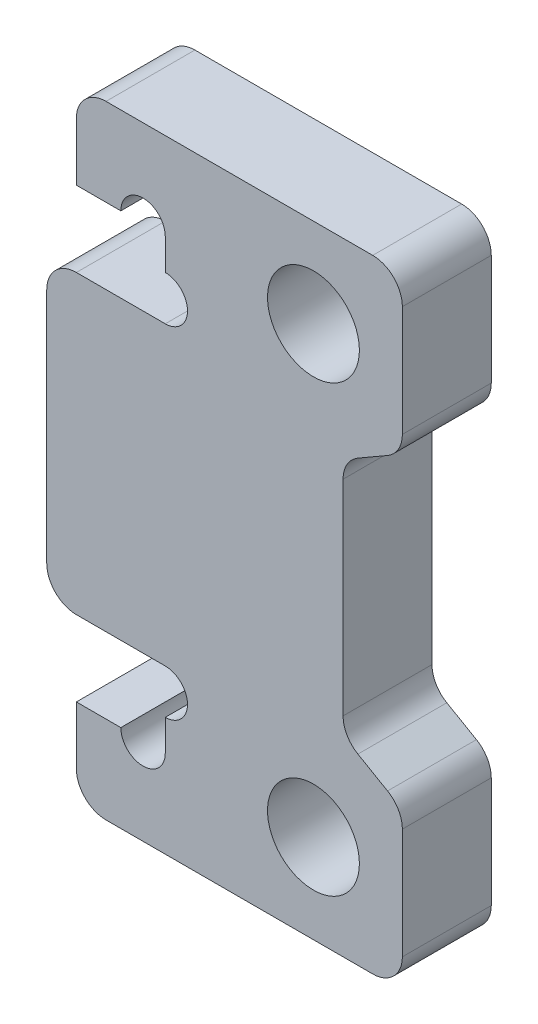
ISO-10303-21;
HEADER;
FILE_DESCRIPTION(('STEP AP214'),'2;1');
FILE_NAME('part.step','',(''),(''),'','','');
FILE_SCHEMA(('AUTOMOTIVE_DESIGN { 1 0 10303 214 1 1 1 1 }'));
ENDSEC;
DATA;
#1=APPLICATION_CONTEXT('core data for automotive mechanical design processes');
#2=APPLICATION_PROTOCOL_DEFINITION('international standard','automotive_design',2000,#1);
#3=PRODUCT_CONTEXT('',#1,'mechanical');
#4=PRODUCT('Part','Part','',(#3));
#5=PRODUCT_RELATED_PRODUCT_CATEGORY('part','',(#4));
#6=PRODUCT_DEFINITION_FORMATION('','',#4);
#7=PRODUCT_DEFINITION_CONTEXT('part definition',#1,'design');
#8=PRODUCT_DEFINITION('design','',#6,#7);
#9=PRODUCT_DEFINITION_SHAPE('','',#8);
#10=(LENGTH_UNIT() NAMED_UNIT(*) SI_UNIT(.MILLI.,.METRE.));
#11=(NAMED_UNIT(*) PLANE_ANGLE_UNIT() SI_UNIT($,.RADIAN.));
#12=(NAMED_UNIT(*) SI_UNIT($,.STERADIAN.) SOLID_ANGLE_UNIT());
#13=UNCERTAINTY_MEASURE_WITH_UNIT(LENGTH_MEASURE(1.E-05),#10,'distance_accuracy_value','');
#14=(GEOMETRIC_REPRESENTATION_CONTEXT(3) GLOBAL_UNCERTAINTY_ASSIGNED_CONTEXT((#13)) GLOBAL_UNIT_ASSIGNED_CONTEXT((#10,
#11,#12)) REPRESENTATION_CONTEXT('',''));
#15=CARTESIAN_POINT('',(0.,0.,0.));
#16=DIRECTION('',(0.,0.,1.));
#17=DIRECTION('',(1.,0.,0.));
#18=AXIS2_PLACEMENT_3D('',#15,#16,#17);
#19=CARTESIAN_POINT('',(-5.,10.5,1.5));
#20=DIRECTION('',(1.,0.,0.));
#21=DIRECTION('',(0.,1.,0.));
#22=AXIS2_PLACEMENT_3D('',#19,#20,#21);
#23=PLANE('',#22);
#24=DIRECTION('',(0.,-1.,0.));
#25=VECTOR('',#24,1.);
#26=CARTESIAN_POINT('',(-5.,10.5,-1.5));
#27=LINE('',#26,#25);
#28=CARTESIAN_POINT('',(-5.,7.55,-1.5));
#29=VERTEX_POINT('',#28);
#30=CARTESIAN_POINT('',(-5.,6.5,-1.5));
#31=VERTEX_POINT('',#30);
#32=EDGE_CURVE('E287',#29,#31,#27,.T.);
#33=ORIENTED_EDGE('',*,*,#32,.T.);
#34=DIRECTION('',(0.,0.,1.));
#35=VECTOR('',#34,1.);
#36=CARTESIAN_POINT('',(-5.,6.5,-1.5));
#37=LINE('',#36,#35);
#38=CARTESIAN_POINT('',(-5.,6.5,1.5));
#39=VERTEX_POINT('',#38);
#40=EDGE_CURVE('E240',#31,#39,#37,.T.);
#41=ORIENTED_EDGE('',*,*,#40,.T.);
#42=DIRECTION('',(0.,-1.,0.));
#43=VECTOR('',#42,1.);
#44=CARTESIAN_POINT('',(-5.,10.5,1.5));
#45=LINE('',#44,#43);
#46=CARTESIAN_POINT('',(-5.,7.55,1.5));
#47=VERTEX_POINT('',#46);
#48=EDGE_CURVE('E256',#47,#39,#45,.T.);
#49=ORIENTED_EDGE('',*,*,#48,.F.);
#50=DIRECTION('',(0.,0.,1.));
#51=VECTOR('',#50,1.);
#52=CARTESIAN_POINT('',(-5.,7.55,-12.270329614269));
#53=LINE('',#52,#51);
#54=EDGE_CURVE('E449',#29,#47,#53,.T.);
#55=ORIENTED_EDGE('',*,*,#54,.F.);
#56=EDGE_LOOP('',(#33,#41,#49,#55));
#57=FACE_BOUND('',#56,.T.);
#58=ADVANCED_FACE('F32',(#57),#23,.F.);
#59=CARTESIAN_POINT('',(-5.,-6.5,1.5));
#60=VERTEX_POINT('',#59);
#61=CARTESIAN_POINT('',(-5.,-7.55,1.5));
#62=VERTEX_POINT('',#61);
#63=EDGE_CURVE('E248',#60,#62,#45,.T.);
#64=ORIENTED_EDGE('',*,*,#63,.F.);
#65=DIRECTION('',(0.,0.,1.));
#66=VECTOR('',#65,1.);
#67=CARTESIAN_POINT('',(-5.,-6.5,-1.5));
#68=LINE('',#67,#66);
#69=CARTESIAN_POINT('',(-5.,-6.5,-1.5));
#70=VERTEX_POINT('',#69);
#71=EDGE_CURVE('E228',#60,#70,#68,.F.);
#72=ORIENTED_EDGE('',*,*,#71,.T.);
#73=CARTESIAN_POINT('',(-5.,-7.55,-1.5));
#74=VERTEX_POINT('',#73);
#75=EDGE_CURVE('E285',#70,#74,#27,.T.);
#76=ORIENTED_EDGE('',*,*,#75,.T.);
#77=DIRECTION('',(0.,0.,1.));
#78=VECTOR('',#77,1.);
#79=CARTESIAN_POINT('',(-5.,-7.55,-12.270329614269));
#80=LINE('',#79,#78);
#81=EDGE_CURVE('E255',#74,#62,#80,.T.);
#82=ORIENTED_EDGE('',*,*,#81,.T.);
#83=EDGE_LOOP('',(#64,#72,#76,#82));
#84=FACE_BOUND('',#83,.T.);
#85=ADVANCED_FACE('F254',(#84),#23,.F.);
#86=CARTESIAN_POINT('',(0.,0.,1.5));
#87=DIRECTION('',(0.,0.,-1.));
#88=DIRECTION('',(-1.,0.,0.));
#89=AXIS2_PLACEMENT_3D('',#86,#87,#88);
#90=PLANE('',#89);
#91=DIRECTION('',(0.86602540378444,0.499999999999998,0.));
#92=VECTOR('',#91,1.);
#93=CARTESIAN_POINT('',(3.,5.19059892324148,1.5));
#94=LINE('',#93,#92);
#95=CARTESIAN_POINT('',(1.50000000000001,4.32457351945705,1.5));
#96=VERTEX_POINT('',#95);
#97=CARTESIAN_POINT('',(2.5,4.90192378864667,1.5));
#98=VERTEX_POINT('',#97);
#99=EDGE_CURVE('E276',#96,#98,#94,.T.);
#100=ORIENTED_EDGE('',*,*,#99,.T.);
#101=CARTESIAN_POINT('',(2.,5.76794919243111,1.5));
#102=DIRECTION('',(0.,0.,-1.));
#103=DIRECTION('',(-1.,0.,0.));
#104=AXIS2_PLACEMENT_3D('',#101,#102,#103);
#105=CIRCLE('',#104,1.);
#106=CARTESIAN_POINT('',(3.,5.76794919243111,1.5));
#107=VERTEX_POINT('',#106);
#108=EDGE_CURVE('E349',#98,#107,#105,.F.);
#109=ORIENTED_EDGE('',*,*,#108,.T.);
#110=DIRECTION('',(0.,1.,0.));
#111=VECTOR('',#110,1.);
#112=CARTESIAN_POINT('',(3.,10.5,1.5));
#113=LINE('',#112,#111);
#114=CARTESIAN_POINT('',(3.,9.5,1.5));
#115=VERTEX_POINT('',#114);
#116=EDGE_CURVE('E278',#107,#115,#113,.T.);
#117=ORIENTED_EDGE('',*,*,#116,.T.);
#118=CARTESIAN_POINT('',(2.,9.5,1.5));
#119=DIRECTION('',(0.,0.,-1.));
#120=DIRECTION('',(-1.,0.,0.));
#121=AXIS2_PLACEMENT_3D('',#118,#119,#120);
#122=CIRCLE('',#121,1.);
#123=CARTESIAN_POINT('',(2.,10.5,1.5));
#124=VERTEX_POINT('',#123);
#125=EDGE_CURVE('E343',#115,#124,#122,.F.);
#126=ORIENTED_EDGE('',*,*,#125,.T.);
#127=DIRECTION('',(-1.,0.,0.));
#128=VECTOR('',#127,1.);
#129=CARTESIAN_POINT('',(-5.,10.5,1.5));
#130=LINE('',#129,#128);
#131=CARTESIAN_POINT('',(-7.,10.5,1.5));
#132=VERTEX_POINT('',#131);
#133=EDGE_CURVE('E257',#124,#132,#130,.T.);
#134=ORIENTED_EDGE('',*,*,#133,.T.);
#135=CARTESIAN_POINT('',(-7.,9.5,1.5));
#136=DIRECTION('',(0.,0.,-1.));
#137=DIRECTION('',(-1.,0.,0.));
#138=AXIS2_PLACEMENT_3D('',#135,#136,#137);
#139=CIRCLE('',#138,1.);
#140=CARTESIAN_POINT('',(-8.,9.5,1.5));
#141=VERTEX_POINT('',#140);
#142=EDGE_CURVE('E47',#132,#141,#139,.F.);
#143=ORIENTED_EDGE('',*,*,#142,.T.);
#144=DIRECTION('',(0.,-1.,0.));
#145=VECTOR('',#144,1.);
#146=CARTESIAN_POINT('',(-8.,10.5,1.5));
#147=LINE('',#146,#145);
#148=CARTESIAN_POINT('',(-8.,7.55,1.5));
#149=VERTEX_POINT('',#148);
#150=EDGE_CURVE('E444',#141,#149,#147,.T.);
#151=ORIENTED_EDGE('',*,*,#150,.T.);
#152=DIRECTION('',(1.,0.,0.));
#153=VECTOR('',#152,1.);
#154=CARTESIAN_POINT('',(-8.,7.55,1.5));
#155=LINE('',#154,#153);
#156=CARTESIAN_POINT('',(-6.5,7.55,1.5));
#157=VERTEX_POINT('',#156);
#158=EDGE_CURVE('E440',#149,#157,#155,.T.);
#159=ORIENTED_EDGE('',*,*,#158,.T.);
#160=CARTESIAN_POINT('',(-5.75,7.55,1.5));
#161=DIRECTION('',(0.,0.,1.));
#162=DIRECTION('',(1.,0.,0.));
#163=AXIS2_PLACEMENT_3D('',#160,#161,#162);
#164=CIRCLE('',#163,0.75);
#165=EDGE_CURVE('E564',#47,#157,#164,.T.);
#166=ORIENTED_EDGE('',*,*,#165,.F.);
#167=ORIENTED_EDGE('',*,*,#48,.T.);
#168=CARTESIAN_POINT('',(-5.,5.75,1.5));
#169=DIRECTION('',(0.,0.,1.));
#170=DIRECTION('',(1.,0.,0.));
#171=AXIS2_PLACEMENT_3D('',#168,#169,#170);
#172=CIRCLE('',#171,0.75);
#173=CARTESIAN_POINT('',(-5.,5.,1.5));
#174=VERTEX_POINT('',#173);
#175=EDGE_CURVE('E572',#174,#39,#172,.T.);
#176=ORIENTED_EDGE('',*,*,#175,.F.);
#177=DIRECTION('',(-1.,0.,0.));
#178=VECTOR('',#177,1.);
#179=CARTESIAN_POINT('',(-5.,5.,1.5));
#180=LINE('',#179,#178);
#181=CARTESIAN_POINT('',(-8.,5.,1.5));
#182=VERTEX_POINT('',#181);
#183=EDGE_CURVE('E581',#174,#182,#180,.T.);
#184=ORIENTED_EDGE('',*,*,#183,.T.);
#185=CARTESIAN_POINT('',(-8.,4.,1.5));
#186=DIRECTION('',(0.,0.,-1.));
#187=DIRECTION('',(-1.,0.,0.));
#188=AXIS2_PLACEMENT_3D('',#185,#186,#187);
#189=CIRCLE('',#188,1.);
#190=CARTESIAN_POINT('',(-9.,4.,1.5));
#191=VERTEX_POINT('',#190);
#192=EDGE_CURVE('E336',#182,#191,#189,.F.);
#193=ORIENTED_EDGE('',*,*,#192,.T.);
#194=DIRECTION('',(0.,-1.,0.));
#195=VECTOR('',#194,1.);
#196=CARTESIAN_POINT('',(-9.,5.,1.5));
#197=LINE('',#196,#195);
#198=CARTESIAN_POINT('',(-9.,-4.,1.5));
#199=VERTEX_POINT('',#198);
#200=EDGE_CURVE('E583',#191,#199,#197,.T.);
#201=ORIENTED_EDGE('',*,*,#200,.T.);
#202=CARTESIAN_POINT('',(-8.,-4.,1.5));
#203=DIRECTION('',(0.,0.,-1.));
#204=DIRECTION('',(-1.,0.,0.));
#205=AXIS2_PLACEMENT_3D('',#202,#203,#204);
#206=CIRCLE('',#205,1.);
#207=CARTESIAN_POINT('',(-8.,-5.,1.5));
#208=VERTEX_POINT('',#207);
#209=EDGE_CURVE('E338',#199,#208,#206,.F.);
#210=ORIENTED_EDGE('',*,*,#209,.T.);
#211=DIRECTION('',(1.,0.,0.));
#212=VECTOR('',#211,1.);
#213=CARTESIAN_POINT('',(-9.,-5.,1.5));
#214=LINE('',#213,#212);
#215=CARTESIAN_POINT('',(-5.,-5.,1.5));
#216=VERTEX_POINT('',#215);
#217=EDGE_CURVE('E251',#208,#216,#214,.T.);
#218=ORIENTED_EDGE('',*,*,#217,.T.);
#219=CARTESIAN_POINT('',(-5.,-5.75,1.5));
#220=DIRECTION('',(0.,0.,1.));
#221=DIRECTION('',(1.,0.,0.));
#222=AXIS2_PLACEMENT_3D('',#219,#220,#221);
#223=CIRCLE('',#222,0.75);
#224=EDGE_CURVE('E232',#60,#216,#223,.T.);
#225=ORIENTED_EDGE('',*,*,#224,.F.);
#226=ORIENTED_EDGE('',*,*,#63,.T.);
#227=CARTESIAN_POINT('',(-5.75,-7.55,1.5));
#228=DIRECTION('',(0.,0.,1.));
#229=DIRECTION('',(1.,0.,0.));
#230=AXIS2_PLACEMENT_3D('',#227,#228,#229);
#231=CIRCLE('',#230,0.75);
#232=CARTESIAN_POINT('',(-6.5,-7.55,1.5));
#233=VERTEX_POINT('',#232);
#234=EDGE_CURVE('E577',#233,#62,#231,.T.);
#235=ORIENTED_EDGE('',*,*,#234,.F.);
#236=DIRECTION('',(-1.,0.,0.));
#237=VECTOR('',#236,1.);
#238=CARTESIAN_POINT('',(-5.,-7.55,1.5));
#239=LINE('',#238,#237);
#240=CARTESIAN_POINT('',(-8.,-7.55,1.5));
#241=VERTEX_POINT('',#240);
#242=EDGE_CURVE('E544',#233,#241,#239,.T.);
#243=ORIENTED_EDGE('',*,*,#242,.T.);
#244=DIRECTION('',(0.,-1.,0.));
#245=VECTOR('',#244,1.);
#246=CARTESIAN_POINT('',(-8.,-7.55,1.5));
#247=LINE('',#246,#245);
#248=CARTESIAN_POINT('',(-8.,-9.5,1.5));
#249=VERTEX_POINT('',#248);
#250=EDGE_CURVE('E545',#241,#249,#247,.T.);
#251=ORIENTED_EDGE('',*,*,#250,.T.);
#252=CARTESIAN_POINT('',(-7.,-9.5,1.5));
#253=DIRECTION('',(0.,0.,-1.));
#254=DIRECTION('',(-1.,0.,0.));
#255=AXIS2_PLACEMENT_3D('',#252,#253,#254);
#256=CIRCLE('',#255,1.);
#257=CARTESIAN_POINT('',(-7.,-10.5,1.5));
#258=VERTEX_POINT('',#257);
#259=EDGE_CURVE('E340',#249,#258,#256,.F.);
#260=ORIENTED_EDGE('',*,*,#259,.T.);
#261=DIRECTION('',(1.,0.,0.));
#262=VECTOR('',#261,1.);
#263=CARTESIAN_POINT('',(3.00000000000001,-10.5,1.5));
#264=LINE('',#263,#262);
#265=CARTESIAN_POINT('',(2.00000000000001,-10.5,1.5));
#266=VERTEX_POINT('',#265);
#267=EDGE_CURVE('E260',#258,#266,#264,.T.);
#268=ORIENTED_EDGE('',*,*,#267,.T.);
#269=CARTESIAN_POINT('',(2.00000000000001,-9.5,1.5));
#270=DIRECTION('',(0.,0.,-1.));
#271=DIRECTION('',(-1.,0.,0.));
#272=AXIS2_PLACEMENT_3D('',#269,#270,#271);
#273=CIRCLE('',#272,1.);
#274=CARTESIAN_POINT('',(3.00000000000001,-9.5,1.5));
#275=VERTEX_POINT('',#274);
#276=EDGE_CURVE('E345',#266,#275,#273,.F.);
#277=ORIENTED_EDGE('',*,*,#276,.T.);
#278=DIRECTION('',(0.,1.,0.));
#279=VECTOR('',#278,1.);
#280=CARTESIAN_POINT('',(3.,-5.19059892324149,1.5));
#281=LINE('',#280,#279);
#282=CARTESIAN_POINT('',(3.,-5.76794919243112,1.5));
#283=VERTEX_POINT('',#282);
#284=EDGE_CURVE('E267',#275,#283,#281,.T.);
#285=ORIENTED_EDGE('',*,*,#284,.T.);
#286=CARTESIAN_POINT('',(2.,-5.76794919243112,1.5));
#287=DIRECTION('',(0.,0.,-1.));
#288=DIRECTION('',(-1.,0.,0.));
#289=AXIS2_PLACEMENT_3D('',#286,#287,#288);
#290=CIRCLE('',#289,1.);
#291=CARTESIAN_POINT('',(2.5,-4.90192378864668,1.5));
#292=VERTEX_POINT('',#291);
#293=EDGE_CURVE('E347',#283,#292,#290,.F.);
#294=ORIENTED_EDGE('',*,*,#293,.T.);
#295=DIRECTION('',(-0.86602540378444,0.499999999999998,0.));
#296=VECTOR('',#295,1.);
#297=CARTESIAN_POINT('',(1.,-4.03589838486224,1.5));
#298=LINE('',#297,#296);
#299=CARTESIAN_POINT('',(1.5,-4.32457351945706,1.5));
#300=VERTEX_POINT('',#299);
#301=EDGE_CURVE('E270',#292,#300,#298,.T.);
#302=ORIENTED_EDGE('',*,*,#301,.T.);
#303=CARTESIAN_POINT('',(2.,-3.45854811567262,1.5));
#304=DIRECTION('',(0.,0.,-1.));
#305=DIRECTION('',(-1.,0.,0.));
#306=AXIS2_PLACEMENT_3D('',#303,#304,#305);
#307=CIRCLE('',#306,1.);
#308=CARTESIAN_POINT('',(1.,-3.45854811567262,1.5));
#309=VERTEX_POINT('',#308);
#310=EDGE_CURVE('E392',#300,#309,#307,.T.);
#311=ORIENTED_EDGE('',*,*,#310,.T.);
#312=DIRECTION('',(0.,1.,0.));
#313=VECTOR('',#312,1.);
#314=CARTESIAN_POINT('',(1.00000000000001,4.03589838486223,1.5));
#315=LINE('',#314,#313);
#316=CARTESIAN_POINT('',(1.00000000000001,3.45854811567261,1.5));
#317=VERTEX_POINT('',#316);
#318=EDGE_CURVE('E273',#309,#317,#315,.T.);
#319=ORIENTED_EDGE('',*,*,#318,.T.);
#320=CARTESIAN_POINT('',(2.00000000000001,3.45854811567261,1.5));
#321=DIRECTION('',(0.,0.,-1.));
#322=DIRECTION('',(-1.,0.,0.));
#323=AXIS2_PLACEMENT_3D('',#320,#321,#322);
#324=CIRCLE('',#323,1.);
#325=EDGE_CURVE('E11',#317,#96,#324,.T.);
#326=ORIENTED_EDGE('',*,*,#325,.T.);
#327=EDGE_LOOP('',(#100,#109,#117,#126,#134,#143,#151,#159,#166,#167,#176,#184,#193,#201,#210,
#218,#225,#226,#235,#243,#251,#260,#268,#277,#285,#294,#302,#311,#319,#326));
#328=FACE_BOUND('',#327,.T.);
#329=CARTESIAN_POINT('',(0.,7.5,1.5));
#330=DIRECTION('',(0.,0.,1.));
#331=DIRECTION('',(1.,0.,0.));
#332=AXIS2_PLACEMENT_3D('',#329,#330,#331);
#333=CIRCLE('',#332,1.55);
#334=CARTESIAN_POINT('',(1.55,7.5,1.5));
#335=VERTEX_POINT('',#334);
#336=EDGE_CURVE('E286',#335,#335,#333,.T.);
#337=ORIENTED_EDGE('',*,*,#336,.F.);
#338=EDGE_LOOP('',(#337));
#339=FACE_BOUND('',#338,.T.);
#340=CARTESIAN_POINT('',(0.,-7.5,1.5));
#341=DIRECTION('',(0.,0.,1.));
#342=DIRECTION('',(1.,0.,0.));
#343=AXIS2_PLACEMENT_3D('',#340,#341,#342);
#344=CIRCLE('',#343,1.55);
#345=CARTESIAN_POINT('',(1.55,-7.5,1.5));
#346=VERTEX_POINT('',#345);
#347=EDGE_CURVE('E452',#346,#346,#344,.T.);
#348=ORIENTED_EDGE('',*,*,#347,.F.);
#349=EDGE_LOOP('',(#348));
#350=FACE_BOUND('',#349,.T.);
#351=ADVANCED_FACE('F245',(#328,#339,#350),#90,.F.);
#352=CARTESIAN_POINT('',(0.,0.,-1.5));
#353=DIRECTION('',(0.,0.,-1.));
#354=DIRECTION('',(-1.,0.,0.));
#355=AXIS2_PLACEMENT_3D('',#352,#353,#354);
#356=PLANE('',#355);
#357=DIRECTION('',(0.,1.,0.));
#358=VECTOR('',#357,1.);
#359=CARTESIAN_POINT('',(3.,10.5,-1.5));
#360=LINE('',#359,#358);
#361=CARTESIAN_POINT('',(3.,5.76794919243111,-1.5));
#362=VERTEX_POINT('',#361);
#363=CARTESIAN_POINT('',(3.,9.5,-1.5));
#364=VERTEX_POINT('',#363);
#365=EDGE_CURVE('E261',#362,#364,#360,.T.);
#366=ORIENTED_EDGE('',*,*,#365,.F.);
#367=CARTESIAN_POINT('',(2.,5.76794919243111,-1.5));
#368=DIRECTION('',(0.,0.,-1.));
#369=DIRECTION('',(-1.,0.,0.));
#370=AXIS2_PLACEMENT_3D('',#367,#368,#369);
#371=CIRCLE('',#370,1.);
#372=CARTESIAN_POINT('',(2.5,4.90192378864667,-1.5));
#373=VERTEX_POINT('',#372);
#374=EDGE_CURVE('E329',#362,#373,#371,.T.);
#375=ORIENTED_EDGE('',*,*,#374,.T.);
#376=DIRECTION('',(0.86602540378444,0.499999999999998,0.));
#377=VECTOR('',#376,1.);
#378=CARTESIAN_POINT('',(3.,5.19059892324148,-1.5));
#379=LINE('',#378,#377);
#380=CARTESIAN_POINT('',(1.50000000000001,4.32457351945705,-1.5));
#381=VERTEX_POINT('',#380);
#382=EDGE_CURVE('E302',#381,#373,#379,.T.);
#383=ORIENTED_EDGE('',*,*,#382,.F.);
#384=CARTESIAN_POINT('',(2.00000000000001,3.45854811567261,-1.5));
#385=DIRECTION('',(0.,0.,-1.));
#386=DIRECTION('',(-1.,0.,0.));
#387=AXIS2_PLACEMENT_3D('',#384,#385,#386);
#388=CIRCLE('',#387,1.);
#389=CARTESIAN_POINT('',(1.00000000000001,3.45854811567261,-1.5));
#390=VERTEX_POINT('',#389);
#391=EDGE_CURVE('E40',#381,#390,#388,.F.);
#392=ORIENTED_EDGE('',*,*,#391,.T.);
#393=DIRECTION('',(0.,1.,0.));
#394=VECTOR('',#393,1.);
#395=CARTESIAN_POINT('',(1.00000000000001,4.03589838486223,-1.5));
#396=LINE('',#395,#394);
#397=CARTESIAN_POINT('',(1.,-3.45854811567262,-1.5));
#398=VERTEX_POINT('',#397);
#399=EDGE_CURVE('E299',#398,#390,#396,.T.);
#400=ORIENTED_EDGE('',*,*,#399,.F.);
#401=CARTESIAN_POINT('',(2.,-3.45854811567262,-1.5));
#402=DIRECTION('',(0.,0.,-1.));
#403=DIRECTION('',(-1.,0.,0.));
#404=AXIS2_PLACEMENT_3D('',#401,#402,#403);
#405=CIRCLE('',#404,1.);
#406=CARTESIAN_POINT('',(1.5,-4.32457351945706,-1.5));
#407=VERTEX_POINT('',#406);
#408=EDGE_CURVE('E390',#398,#407,#405,.F.);
#409=ORIENTED_EDGE('',*,*,#408,.T.);
#410=DIRECTION('',(-0.86602540378444,0.499999999999998,0.));
#411=VECTOR('',#410,1.);
#412=CARTESIAN_POINT('',(1.,-4.03589838486224,-1.5));
#413=LINE('',#412,#411);
#414=CARTESIAN_POINT('',(2.5,-4.90192378864668,-1.5));
#415=VERTEX_POINT('',#414);
#416=EDGE_CURVE('E296',#415,#407,#413,.T.);
#417=ORIENTED_EDGE('',*,*,#416,.F.);
#418=CARTESIAN_POINT('',(2.,-5.76794919243112,-1.5));
#419=DIRECTION('',(0.,0.,-1.));
#420=DIRECTION('',(-1.,0.,0.));
#421=AXIS2_PLACEMENT_3D('',#418,#419,#420);
#422=CIRCLE('',#421,1.);
#423=CARTESIAN_POINT('',(3.,-5.76794919243112,-1.5));
#424=VERTEX_POINT('',#423);
#425=EDGE_CURVE('E327',#415,#424,#422,.T.);
#426=ORIENTED_EDGE('',*,*,#425,.T.);
#427=DIRECTION('',(0.,1.,0.));
#428=VECTOR('',#427,1.);
#429=CARTESIAN_POINT('',(3.,-5.19059892324149,-1.5));
#430=LINE('',#429,#428);
#431=CARTESIAN_POINT('',(3.00000000000001,-9.5,-1.5));
#432=VERTEX_POINT('',#431);
#433=EDGE_CURVE('E293',#432,#424,#430,.T.);
#434=ORIENTED_EDGE('',*,*,#433,.F.);
#435=CARTESIAN_POINT('',(2.00000000000001,-9.5,-1.5));
#436=DIRECTION('',(0.,0.,-1.));
#437=DIRECTION('',(-1.,0.,0.));
#438=AXIS2_PLACEMENT_3D('',#435,#436,#437);
#439=CIRCLE('',#438,1.);
#440=CARTESIAN_POINT('',(2.00000000000001,-10.5,-1.5));
#441=VERTEX_POINT('',#440);
#442=EDGE_CURVE('E325',#432,#441,#439,.T.);
#443=ORIENTED_EDGE('',*,*,#442,.T.);
#444=DIRECTION('',(1.,0.,0.));
#445=VECTOR('',#444,1.);
#446=CARTESIAN_POINT('',(3.00000000000001,-10.5,-1.5));
#447=LINE('',#446,#445);
#448=CARTESIAN_POINT('',(-7.,-10.5,-1.5));
#449=VERTEX_POINT('',#448);
#450=EDGE_CURVE('E290',#449,#441,#447,.T.);
#451=ORIENTED_EDGE('',*,*,#450,.F.);
#452=CARTESIAN_POINT('',(-7.,-9.5,-1.5));
#453=DIRECTION('',(0.,0.,-1.));
#454=DIRECTION('',(-1.,0.,0.));
#455=AXIS2_PLACEMENT_3D('',#452,#453,#454);
#456=CIRCLE('',#455,1.);
#457=CARTESIAN_POINT('',(-8.,-9.5,-1.5));
#458=VERTEX_POINT('',#457);
#459=EDGE_CURVE('E319',#449,#458,#456,.T.);
#460=ORIENTED_EDGE('',*,*,#459,.T.);
#461=DIRECTION('',(0.,-1.,0.));
#462=VECTOR('',#461,1.);
#463=CARTESIAN_POINT('',(-8.,-7.55,-1.5));
#464=LINE('',#463,#462);
#465=CARTESIAN_POINT('',(-8.,-7.55,-1.5));
#466=VERTEX_POINT('',#465);
#467=EDGE_CURVE('E552',#466,#458,#464,.T.);
#468=ORIENTED_EDGE('',*,*,#467,.F.);
#469=DIRECTION('',(-1.,0.,0.));
#470=VECTOR('',#469,1.);
#471=CARTESIAN_POINT('',(-5.,-7.55,-1.5));
#472=LINE('',#471,#470);
#473=CARTESIAN_POINT('',(-6.5,-7.55,-1.5));
#474=VERTEX_POINT('',#473);
#475=EDGE_CURVE('E548',#474,#466,#472,.T.);
#476=ORIENTED_EDGE('',*,*,#475,.F.);
#477=CARTESIAN_POINT('',(-5.75,-7.55,-1.5));
#478=DIRECTION('',(0.,0.,1.));
#479=DIRECTION('',(1.,0.,0.));
#480=AXIS2_PLACEMENT_3D('',#477,#478,#479);
#481=CIRCLE('',#480,0.75);
#482=EDGE_CURVE('E252',#474,#74,#481,.T.);
#483=ORIENTED_EDGE('',*,*,#482,.T.);
#484=ORIENTED_EDGE('',*,*,#75,.F.);
#485=CARTESIAN_POINT('',(-5.,-5.75,-1.5));
#486=DIRECTION('',(0.,0.,1.));
#487=DIRECTION('',(1.,0.,0.));
#488=AXIS2_PLACEMENT_3D('',#485,#486,#487);
#489=CIRCLE('',#488,0.75);
#490=CARTESIAN_POINT('',(-5.,-5.,-1.5));
#491=VERTEX_POINT('',#490);
#492=EDGE_CURVE('E235',#70,#491,#489,.T.);
#493=ORIENTED_EDGE('',*,*,#492,.T.);
#494=DIRECTION('',(1.,0.,0.));
#495=VECTOR('',#494,1.);
#496=CARTESIAN_POINT('',(-9.,-5.,-1.5));
#497=LINE('',#496,#495);
#498=CARTESIAN_POINT('',(-8.,-5.,-1.5));
#499=VERTEX_POINT('',#498);
#500=EDGE_CURVE('E528',#499,#491,#497,.T.);
#501=ORIENTED_EDGE('',*,*,#500,.F.);
#502=CARTESIAN_POINT('',(-8.,-4.,-1.5));
#503=DIRECTION('',(0.,0.,-1.));
#504=DIRECTION('',(-1.,0.,0.));
#505=AXIS2_PLACEMENT_3D('',#502,#503,#504);
#506=CIRCLE('',#505,1.);
#507=CARTESIAN_POINT('',(-9.,-4.,-1.5));
#508=VERTEX_POINT('',#507);
#509=EDGE_CURVE('E317',#499,#508,#506,.T.);
#510=ORIENTED_EDGE('',*,*,#509,.T.);
#511=DIRECTION('',(0.,-1.,0.));
#512=VECTOR('',#511,1.);
#513=CARTESIAN_POINT('',(-9.,5.,-1.5));
#514=LINE('',#513,#512);
#515=CARTESIAN_POINT('',(-9.,4.,-1.5));
#516=VERTEX_POINT('',#515);
#517=EDGE_CURVE('E526',#516,#508,#514,.T.);
#518=ORIENTED_EDGE('',*,*,#517,.F.);
#519=CARTESIAN_POINT('',(-8.,4.,-1.5));
#520=DIRECTION('',(0.,0.,-1.));
#521=DIRECTION('',(-1.,0.,0.));
#522=AXIS2_PLACEMENT_3D('',#519,#520,#521);
#523=CIRCLE('',#522,1.);
#524=CARTESIAN_POINT('',(-8.,5.,-1.5));
#525=VERTEX_POINT('',#524);
#526=EDGE_CURVE('E315',#516,#525,#523,.T.);
#527=ORIENTED_EDGE('',*,*,#526,.T.);
#528=DIRECTION('',(-1.,0.,0.));
#529=VECTOR('',#528,1.);
#530=CARTESIAN_POINT('',(-5.,5.,-1.5));
#531=LINE('',#530,#529);
#532=CARTESIAN_POINT('',(-5.,5.,-1.5));
#533=VERTEX_POINT('',#532);
#534=EDGE_CURVE('E534',#533,#525,#531,.T.);
#535=ORIENTED_EDGE('',*,*,#534,.F.);
#536=CARTESIAN_POINT('',(-5.,5.75,-1.5));
#537=DIRECTION('',(0.,0.,1.));
#538=DIRECTION('',(1.,0.,0.));
#539=AXIS2_PLACEMENT_3D('',#536,#537,#538);
#540=CIRCLE('',#539,0.75);
#541=EDGE_CURVE('E568',#533,#31,#540,.T.);
#542=ORIENTED_EDGE('',*,*,#541,.T.);
#543=ORIENTED_EDGE('',*,*,#32,.F.);
#544=CARTESIAN_POINT('',(-5.75,7.55,-1.5));
#545=DIRECTION('',(0.,0.,1.));
#546=DIRECTION('',(1.,0.,0.));
#547=AXIS2_PLACEMENT_3D('',#544,#545,#546);
#548=CIRCLE('',#547,0.75);
#549=CARTESIAN_POINT('',(-6.5,7.55,-1.5));
#550=VERTEX_POINT('',#549);
#551=EDGE_CURVE('E241',#29,#550,#548,.T.);
#552=ORIENTED_EDGE('',*,*,#551,.T.);
#553=DIRECTION('',(1.,0.,0.));
#554=VECTOR('',#553,1.);
#555=CARTESIAN_POINT('',(-8.,7.55,-1.5));
#556=LINE('',#555,#554);
#557=CARTESIAN_POINT('',(-8.,7.55,-1.5));
#558=VERTEX_POINT('',#557);
#559=EDGE_CURVE('E435',#558,#550,#556,.T.);
#560=ORIENTED_EDGE('',*,*,#559,.F.);
#561=DIRECTION('',(0.,-1.,0.));
#562=VECTOR('',#561,1.);
#563=CARTESIAN_POINT('',(-8.,10.5,-1.5));
#564=LINE('',#563,#562);
#565=CARTESIAN_POINT('',(-8.,9.5,-1.5));
#566=VERTEX_POINT('',#565);
#567=EDGE_CURVE('E432',#566,#558,#564,.T.);
#568=ORIENTED_EDGE('',*,*,#567,.F.);
#569=CARTESIAN_POINT('',(-7.,9.5,-1.5));
#570=DIRECTION('',(0.,0.,-1.));
#571=DIRECTION('',(-1.,0.,0.));
#572=AXIS2_PLACEMENT_3D('',#569,#570,#571);
#573=CIRCLE('',#572,1.);
#574=CARTESIAN_POINT('',(-7.,10.5,-1.5));
#575=VERTEX_POINT('',#574);
#576=EDGE_CURVE('E321',#566,#575,#573,.T.);
#577=ORIENTED_EDGE('',*,*,#576,.T.);
#578=DIRECTION('',(-1.,0.,0.));
#579=VECTOR('',#578,1.);
#580=CARTESIAN_POINT('',(-5.,10.5,-1.5));
#581=LINE('',#580,#579);
#582=CARTESIAN_POINT('',(2.,10.5,-1.5));
#583=VERTEX_POINT('',#582);
#584=EDGE_CURVE('E282',#583,#575,#581,.T.);
#585=ORIENTED_EDGE('',*,*,#584,.F.);
#586=CARTESIAN_POINT('',(2.,9.5,-1.5));
#587=DIRECTION('',(0.,0.,-1.));
#588=DIRECTION('',(-1.,0.,0.));
#589=AXIS2_PLACEMENT_3D('',#586,#587,#588);
#590=CIRCLE('',#589,1.);
#591=EDGE_CURVE('E323',#583,#364,#590,.T.);
#592=ORIENTED_EDGE('',*,*,#591,.T.);
#593=EDGE_LOOP('',(#366,#375,#383,#392,#400,#409,#417,#426,#434,#443,#451,#460,#468,#476,#483,
#484,#493,#501,#510,#518,#527,#535,#542,#543,#552,#560,#568,#577,#585,#592));
#594=FACE_BOUND('',#593,.T.);
#595=CARTESIAN_POINT('',(0.,7.5,-1.5));
#596=DIRECTION('',(0.,0.,1.));
#597=DIRECTION('',(1.,0.,0.));
#598=AXIS2_PLACEMENT_3D('',#595,#596,#597);
#599=CIRCLE('',#598,1.55);
#600=CARTESIAN_POINT('',(1.55,7.5,-1.5));
#601=VERTEX_POINT('',#600);
#602=EDGE_CURVE('E455',#601,#601,#599,.T.);
#603=ORIENTED_EDGE('',*,*,#602,.T.);
#604=EDGE_LOOP('',(#603));
#605=FACE_BOUND('',#604,.T.);
#606=CARTESIAN_POINT('',(0.,-7.5,-1.5));
#607=DIRECTION('',(0.,0.,1.));
#608=DIRECTION('',(1.,0.,0.));
#609=AXIS2_PLACEMENT_3D('',#606,#607,#608);
#610=CIRCLE('',#609,1.55);
#611=CARTESIAN_POINT('',(1.55,-7.5,-1.5));
#612=VERTEX_POINT('',#611);
#613=EDGE_CURVE('E450',#612,#612,#610,.T.);
#614=ORIENTED_EDGE('',*,*,#613,.T.);
#615=EDGE_LOOP('',(#614));
#616=FACE_BOUND('',#615,.T.);
#617=ADVANCED_FACE('F397',(#594,#605,#616),#356,.T.);
#618=CARTESIAN_POINT('',(-5.,10.5,1.5));
#619=DIRECTION('',(0.,-1.,0.));
#620=DIRECTION('',(0.,0.,-1.));
#621=AXIS2_PLACEMENT_3D('',#618,#619,#620);
#622=PLANE('',#621);
#623=ORIENTED_EDGE('',*,*,#133,.F.);
#624=DIRECTION('',(0.,0.,-1.));
#625=VECTOR('',#624,1.);
#626=CARTESIAN_POINT('',(2.,10.5,1.5));
#627=LINE('',#626,#625);
#628=EDGE_CURVE('E367',#124,#583,#627,.T.);
#629=ORIENTED_EDGE('',*,*,#628,.T.);
#630=ORIENTED_EDGE('',*,*,#584,.T.);
#631=DIRECTION('',(0.,0.,1.));
#632=VECTOR('',#631,1.);
#633=CARTESIAN_POINT('',(-7.,10.5,1.5));
#634=LINE('',#633,#632);
#635=EDGE_CURVE('E365',#575,#132,#634,.T.);
#636=ORIENTED_EDGE('',*,*,#635,.T.);
#637=EDGE_LOOP('',(#623,#629,#630,#636));
#638=FACE_BOUND('',#637,.T.);
#639=ADVANCED_FACE('F426',(#638),#622,.F.);
#640=CARTESIAN_POINT('',(3.00000000000001,-10.5,1.5));
#641=DIRECTION('',(0.,1.,0.));
#642=DIRECTION('',(-1.,0.,0.));
#643=AXIS2_PLACEMENT_3D('',#640,#641,#642);
#644=PLANE('',#643);
#645=ORIENTED_EDGE('',*,*,#450,.T.);
#646=DIRECTION('',(0.,0.,-1.));
#647=VECTOR('',#646,1.);
#648=CARTESIAN_POINT('',(2.00000000000001,-10.5,1.5));
#649=LINE('',#648,#647);
#650=EDGE_CURVE('E363',#441,#266,#649,.F.);
#651=ORIENTED_EDGE('',*,*,#650,.T.);
#652=ORIENTED_EDGE('',*,*,#267,.F.);
#653=DIRECTION('',(0.,0.,1.));
#654=VECTOR('',#653,1.);
#655=CARTESIAN_POINT('',(-7.,-10.5,-1.5));
#656=LINE('',#655,#654);
#657=EDGE_CURVE('E361',#258,#449,#656,.F.);
#658=ORIENTED_EDGE('',*,*,#657,.T.);
#659=EDGE_LOOP('',(#645,#651,#652,#658));
#660=FACE_BOUND('',#659,.T.);
#661=ADVANCED_FACE('F485',(#660),#644,.F.);
#662=CARTESIAN_POINT('',(3.,-5.19059892324149,1.5));
#663=DIRECTION('',(-1.,0.,0.));
#664=DIRECTION('',(0.,-1.,0.));
#665=AXIS2_PLACEMENT_3D('',#662,#663,#664);
#666=PLANE('',#665);
#667=ORIENTED_EDGE('',*,*,#433,.T.);
#668=DIRECTION('',(0.,0.,-1.));
#669=VECTOR('',#668,1.);
#670=CARTESIAN_POINT('',(3.,-5.76794919243112,1.5));
#671=LINE('',#670,#669);
#672=EDGE_CURVE('E359',#424,#283,#671,.F.);
#673=ORIENTED_EDGE('',*,*,#672,.T.);
#674=ORIENTED_EDGE('',*,*,#284,.F.);
#675=DIRECTION('',(0.,0.,-1.));
#676=VECTOR('',#675,1.);
#677=CARTESIAN_POINT('',(3.00000000000001,-9.5,1.5));
#678=LINE('',#677,#676);
#679=EDGE_CURVE('E356',#275,#432,#678,.T.);
#680=ORIENTED_EDGE('',*,*,#679,.T.);
#681=EDGE_LOOP('',(#667,#673,#674,#680));
#682=FACE_BOUND('',#681,.T.);
#683=ADVANCED_FACE('F714',(#682),#666,.F.);
#684=CARTESIAN_POINT('',(1.,-4.03589838486224,1.5));
#685=DIRECTION('',(-0.499999999999998,-0.86602540378444,0.));
#686=DIRECTION('',(0.86602540378444,-0.499999999999998,0.));
#687=AXIS2_PLACEMENT_3D('',#684,#685,#686);
#688=PLANE('',#687);
#689=ORIENTED_EDGE('',*,*,#301,.F.);
#690=DIRECTION('',(0.,0.,-1.));
#691=VECTOR('',#690,1.);
#692=CARTESIAN_POINT('',(2.5,-4.90192378864668,1.5));
#693=LINE('',#692,#691);
#694=EDGE_CURVE('E353',#292,#415,#693,.T.);
#695=ORIENTED_EDGE('',*,*,#694,.T.);
#696=ORIENTED_EDGE('',*,*,#416,.T.);
#697=DIRECTION('',(0.,0.,-1.));
#698=VECTOR('',#697,1.);
#699=CARTESIAN_POINT('',(1.5,-4.32457351945706,1.5));
#700=LINE('',#699,#698);
#701=EDGE_CURVE('E351',#407,#300,#700,.F.);
#702=ORIENTED_EDGE('',*,*,#701,.T.);
#703=EDGE_LOOP('',(#689,#695,#696,#702));
#704=FACE_BOUND('',#703,.T.);
#705=ADVANCED_FACE('F724',(#704),#688,.F.);
#706=CARTESIAN_POINT('',(1.00000000000001,4.03589838486223,1.5));
#707=DIRECTION('',(-1.,0.,0.));
#708=DIRECTION('',(0.,-1.,0.));
#709=AXIS2_PLACEMENT_3D('',#706,#707,#708);
#710=PLANE('',#709);
#711=ORIENTED_EDGE('',*,*,#318,.F.);
#712=DIRECTION('',(0.,0.,-1.));
#713=VECTOR('',#712,1.);
#714=CARTESIAN_POINT('',(1.,-3.45854811567262,-1.5));
#715=LINE('',#714,#713);
#716=EDGE_CURVE('E372',#309,#398,#715,.T.);
#717=ORIENTED_EDGE('',*,*,#716,.T.);
#718=ORIENTED_EDGE('',*,*,#399,.T.);
#719=DIRECTION('',(0.,0.,-1.));
#720=VECTOR('',#719,1.);
#721=CARTESIAN_POINT('',(1.00000000000001,3.45854811567261,1.5));
#722=LINE('',#721,#720);
#723=EDGE_CURVE('E370',#390,#317,#722,.F.);
#724=ORIENTED_EDGE('',*,*,#723,.T.);
#725=EDGE_LOOP('',(#711,#717,#718,#724));
#726=FACE_BOUND('',#725,.T.);
#727=ADVANCED_FACE('F404',(#726),#710,.F.);
#728=CARTESIAN_POINT('',(3.,5.19059892324148,1.5));
#729=DIRECTION('',(-0.499999999999998,0.86602540378444,0.));
#730=DIRECTION('',(-0.86602540378444,-0.499999999999998,0.));
#731=AXIS2_PLACEMENT_3D('',#728,#729,#730);
#732=PLANE('',#731);
#733=ORIENTED_EDGE('',*,*,#382,.T.);
#734=DIRECTION('',(0.,0.,-1.));
#735=VECTOR('',#734,1.);
#736=CARTESIAN_POINT('',(2.5,4.90192378864667,1.5));
#737=LINE('',#736,#735);
#738=EDGE_CURVE('E334',#373,#98,#737,.F.);
#739=ORIENTED_EDGE('',*,*,#738,.T.);
#740=ORIENTED_EDGE('',*,*,#99,.F.);
#741=DIRECTION('',(0.,0.,-1.));
#742=VECTOR('',#741,1.);
#743=CARTESIAN_POINT('',(1.50000000000001,4.32457351945705,-1.5));
#744=LINE('',#743,#742);
#745=EDGE_CURVE('E331',#96,#381,#744,.T.);
#746=ORIENTED_EDGE('',*,*,#745,.T.);
#747=EDGE_LOOP('',(#733,#739,#740,#746));
#748=FACE_BOUND('',#747,.T.);
#749=ADVANCED_FACE('F411',(#748),#732,.F.);
#750=CARTESIAN_POINT('',(3.,10.5,1.5));
#751=DIRECTION('',(-1.,0.,0.));
#752=DIRECTION('',(0.,-1.,0.));
#753=AXIS2_PLACEMENT_3D('',#750,#751,#752);
#754=PLANE('',#753);
#755=ORIENTED_EDGE('',*,*,#116,.F.);
#756=DIRECTION('',(0.,0.,-1.));
#757=VECTOR('',#756,1.);
#758=CARTESIAN_POINT('',(3.,5.76794919243111,1.5));
#759=LINE('',#758,#757);
#760=EDGE_CURVE('E312',#107,#362,#759,.T.);
#761=ORIENTED_EDGE('',*,*,#760,.T.);
#762=ORIENTED_EDGE('',*,*,#365,.T.);
#763=DIRECTION('',(0.,0.,-1.));
#764=VECTOR('',#763,1.);
#765=CARTESIAN_POINT('',(3.,9.5,1.5));
#766=LINE('',#765,#764);
#767=EDGE_CURVE('E310',#364,#115,#766,.F.);
#768=ORIENTED_EDGE('',*,*,#767,.T.);
#769=EDGE_LOOP('',(#755,#761,#762,#768));
#770=FACE_BOUND('',#769,.T.);
#771=ADVANCED_FACE('F419',(#770),#754,.F.);
#772=CARTESIAN_POINT('',(0.,7.5,1.5));
#773=DIRECTION('',(0.,0.,-1.));
#774=DIRECTION('',(-1.,0.,0.));
#775=AXIS2_PLACEMENT_3D('',#772,#773,#774);
#776=CYLINDRICAL_SURFACE('',#775,1.55);
#777=ORIENTED_EDGE('',*,*,#336,.T.);
#778=EDGE_LOOP('',(#777));
#779=FACE_BOUND('',#778,.T.);
#780=ORIENTED_EDGE('',*,*,#602,.F.);
#781=EDGE_LOOP('',(#780));
#782=FACE_BOUND('',#781,.T.);
#783=ADVANCED_FACE('F463',(#779,#782),#776,.F.);
#784=CARTESIAN_POINT('',(0.,-7.5,1.5));
#785=DIRECTION('',(0.,0.,-1.));
#786=DIRECTION('',(-1.,0.,0.));
#787=AXIS2_PLACEMENT_3D('',#784,#785,#786);
#788=CYLINDRICAL_SURFACE('',#787,1.55);
#789=ORIENTED_EDGE('',*,*,#347,.T.);
#790=EDGE_LOOP('',(#789));
#791=FACE_BOUND('',#790,.T.);
#792=ORIENTED_EDGE('',*,*,#613,.F.);
#793=EDGE_LOOP('',(#792));
#794=FACE_BOUND('',#793,.T.);
#795=ADVANCED_FACE('F465',(#791,#794),#788,.F.);
#796=CARTESIAN_POINT('',(-8.,10.5,-12.270329614269));
#797=DIRECTION('',(-1.,0.,0.));
#798=DIRECTION('',(0.,0.,1.));
#799=AXIS2_PLACEMENT_3D('',#796,#797,#798);
#800=PLANE('',#799);
#801=ORIENTED_EDGE('',*,*,#150,.F.);
#802=DIRECTION('',(0.,0.,1.));
#803=VECTOR('',#802,1.);
#804=CARTESIAN_POINT('',(-8.,9.5,-1.5));
#805=LINE('',#804,#803);
#806=EDGE_CURVE('E375',#141,#566,#805,.F.);
#807=ORIENTED_EDGE('',*,*,#806,.T.);
#808=ORIENTED_EDGE('',*,*,#567,.T.);
#809=DIRECTION('',(0.,0.,1.));
#810=VECTOR('',#809,1.);
#811=CARTESIAN_POINT('',(-8.,7.55,-12.270329614269));
#812=LINE('',#811,#810);
#813=EDGE_CURVE('E439',#558,#149,#812,.T.);
#814=ORIENTED_EDGE('',*,*,#813,.T.);
#815=EDGE_LOOP('',(#801,#807,#808,#814));
#816=FACE_BOUND('',#815,.T.);
#817=ADVANCED_FACE('F472',(#816),#800,.T.);
#818=CARTESIAN_POINT('',(-8.,7.55,-12.270329614269));
#819=DIRECTION('',(0.,-1.,0.));
#820=DIRECTION('',(0.,0.,-1.));
#821=AXIS2_PLACEMENT_3D('',#818,#819,#820);
#822=PLANE('',#821);
#823=DIRECTION('',(0.,0.,1.));
#824=VECTOR('',#823,1.);
#825=CARTESIAN_POINT('',(-6.5,7.55,-1.5));
#826=LINE('',#825,#824);
#827=EDGE_CURVE('E308',#157,#550,#826,.F.);
#828=ORIENTED_EDGE('',*,*,#827,.F.);
#829=ORIENTED_EDGE('',*,*,#158,.F.);
#830=ORIENTED_EDGE('',*,*,#813,.F.);
#831=ORIENTED_EDGE('',*,*,#559,.T.);
#832=EDGE_LOOP('',(#828,#829,#830,#831));
#833=FACE_BOUND('',#832,.T.);
#834=ADVANCED_FACE('F561',(#833),#822,.T.);
#835=CARTESIAN_POINT('',(-5.,-7.55,-12.270329614269));
#836=DIRECTION('',(0.,1.,0.));
#837=DIRECTION('',(0.,0.,1.));
#838=AXIS2_PLACEMENT_3D('',#835,#836,#837);
#839=PLANE('',#838);
#840=DIRECTION('',(0.,0.,1.));
#841=VECTOR('',#840,1.);
#842=CARTESIAN_POINT('',(-6.5,-7.55,-1.5));
#843=LINE('',#842,#841);
#844=EDGE_CURVE('E281',#474,#233,#843,.T.);
#845=ORIENTED_EDGE('',*,*,#844,.F.);
#846=ORIENTED_EDGE('',*,*,#475,.T.);
#847=DIRECTION('',(0.,0.,1.));
#848=VECTOR('',#847,1.);
#849=CARTESIAN_POINT('',(-8.,-7.55,-12.270329614269));
#850=LINE('',#849,#848);
#851=EDGE_CURVE('E551',#466,#241,#850,.T.);
#852=ORIENTED_EDGE('',*,*,#851,.T.);
#853=ORIENTED_EDGE('',*,*,#242,.F.);
#854=EDGE_LOOP('',(#845,#846,#852,#853));
#855=FACE_BOUND('',#854,.T.);
#856=ADVANCED_FACE('F619',(#855),#839,.T.);
#857=CARTESIAN_POINT('',(-8.,-7.55,-12.270329614269));
#858=DIRECTION('',(-1.,0.,0.));
#859=DIRECTION('',(0.,0.,1.));
#860=AXIS2_PLACEMENT_3D('',#857,#858,#859);
#861=PLANE('',#860);
#862=ORIENTED_EDGE('',*,*,#467,.T.);
#863=DIRECTION('',(0.,0.,1.));
#864=VECTOR('',#863,1.);
#865=CARTESIAN_POINT('',(-8.,-9.5,1.5));
#866=LINE('',#865,#864);
#867=EDGE_CURVE('E377',#458,#249,#866,.T.);
#868=ORIENTED_EDGE('',*,*,#867,.T.);
#869=ORIENTED_EDGE('',*,*,#250,.F.);
#870=ORIENTED_EDGE('',*,*,#851,.F.);
#871=EDGE_LOOP('',(#862,#868,#869,#870));
#872=FACE_BOUND('',#871,.T.);
#873=ADVANCED_FACE('F616',(#872),#861,.T.);
#874=CARTESIAN_POINT('',(-5.,5.,-12.270329614269));
#875=DIRECTION('',(0.,1.,0.));
#876=DIRECTION('',(-1.,0.,0.));
#877=AXIS2_PLACEMENT_3D('',#874,#875,#876);
#878=PLANE('',#877);
#879=ORIENTED_EDGE('',*,*,#534,.T.);
#880=DIRECTION('',(0.,0.,1.));
#881=VECTOR('',#880,1.);
#882=CARTESIAN_POINT('',(-8.,5.,-12.270329614269));
#883=LINE('',#882,#881);
#884=EDGE_CURVE('E387',#525,#182,#883,.T.);
#885=ORIENTED_EDGE('',*,*,#884,.T.);
#886=ORIENTED_EDGE('',*,*,#183,.F.);
#887=DIRECTION('',(0.,0.,1.));
#888=VECTOR('',#887,1.);
#889=CARTESIAN_POINT('',(-5.,5.,-12.270329614269));
#890=LINE('',#889,#888);
#891=EDGE_CURVE('E542',#533,#174,#890,.T.);
#892=ORIENTED_EDGE('',*,*,#891,.F.);
#893=EDGE_LOOP('',(#879,#885,#886,#892));
#894=FACE_BOUND('',#893,.T.);
#895=ADVANCED_FACE('F590',(#894),#878,.T.);
#896=CARTESIAN_POINT('',(-9.,5.,-12.270329614269));
#897=DIRECTION('',(-1.,0.,0.));
#898=DIRECTION('',(0.,0.,1.));
#899=AXIS2_PLACEMENT_3D('',#896,#897,#898);
#900=PLANE('',#899);
#901=ORIENTED_EDGE('',*,*,#517,.T.);
#902=DIRECTION('',(0.,0.,1.));
#903=VECTOR('',#902,1.);
#904=CARTESIAN_POINT('',(-9.,-4.,-12.270329614269));
#905=LINE('',#904,#903);
#906=EDGE_CURVE('E382',#508,#199,#905,.T.);
#907=ORIENTED_EDGE('',*,*,#906,.T.);
#908=ORIENTED_EDGE('',*,*,#200,.F.);
#909=DIRECTION('',(0.,0.,1.));
#910=VECTOR('',#909,1.);
#911=CARTESIAN_POINT('',(-9.,4.,-12.270329614269));
#912=LINE('',#911,#910);
#913=EDGE_CURVE('E380',#191,#516,#912,.F.);
#914=ORIENTED_EDGE('',*,*,#913,.T.);
#915=EDGE_LOOP('',(#901,#907,#908,#914));
#916=FACE_BOUND('',#915,.T.);
#917=ADVANCED_FACE('F530',(#916),#900,.T.);
#918=CARTESIAN_POINT('',(-9.,-5.,-12.270329614269));
#919=DIRECTION('',(0.,-1.,0.));
#920=DIRECTION('',(1.,0.,0.));
#921=AXIS2_PLACEMENT_3D('',#918,#919,#920);
#922=PLANE('',#921);
#923=ORIENTED_EDGE('',*,*,#217,.F.);
#924=DIRECTION('',(0.,0.,1.));
#925=VECTOR('',#924,1.);
#926=CARTESIAN_POINT('',(-8.,-5.,-12.270329614269));
#927=LINE('',#926,#925);
#928=EDGE_CURVE('E385',#208,#499,#927,.F.);
#929=ORIENTED_EDGE('',*,*,#928,.T.);
#930=ORIENTED_EDGE('',*,*,#500,.T.);
#931=DIRECTION('',(0.,0.,1.));
#932=VECTOR('',#931,1.);
#933=CARTESIAN_POINT('',(-5.,-5.,-12.270329614269));
#934=LINE('',#933,#932);
#935=EDGE_CURVE('E536',#491,#216,#934,.T.);
#936=ORIENTED_EDGE('',*,*,#935,.T.);
#937=EDGE_LOOP('',(#923,#929,#930,#936));
#938=FACE_BOUND('',#937,.T.);
#939=ADVANCED_FACE('F605',(#938),#922,.T.);
#940=CARTESIAN_POINT('',(-5.,-5.75,-1.5));
#941=DIRECTION('',(0.,0.,1.));
#942=DIRECTION('',(1.,0.,0.));
#943=AXIS2_PLACEMENT_3D('',#940,#941,#942);
#944=CYLINDRICAL_SURFACE('',#943,0.75);
#945=ORIENTED_EDGE('',*,*,#224,.T.);
#946=ORIENTED_EDGE('',*,*,#935,.F.);
#947=ORIENTED_EDGE('',*,*,#492,.F.);
#948=ORIENTED_EDGE('',*,*,#71,.F.);
#949=EDGE_LOOP('',(#945,#946,#947,#948));
#950=FACE_BOUND('',#949,.T.);
#951=ADVANCED_FACE('F230',(#950),#944,.F.);
#952=CARTESIAN_POINT('',(-5.,5.75,-1.5));
#953=DIRECTION('',(0.,0.,1.));
#954=DIRECTION('',(1.,0.,0.));
#955=AXIS2_PLACEMENT_3D('',#952,#953,#954);
#956=CYLINDRICAL_SURFACE('',#955,0.75);
#957=ORIENTED_EDGE('',*,*,#541,.F.);
#958=ORIENTED_EDGE('',*,*,#891,.T.);
#959=ORIENTED_EDGE('',*,*,#175,.T.);
#960=ORIENTED_EDGE('',*,*,#40,.F.);
#961=EDGE_LOOP('',(#957,#958,#959,#960));
#962=FACE_BOUND('',#961,.T.);
#963=ADVANCED_FACE('F595',(#962),#956,.F.);
#964=CARTESIAN_POINT('',(-5.75,-7.55,-1.5));
#965=DIRECTION('',(0.,0.,1.));
#966=DIRECTION('',(1.,0.,0.));
#967=AXIS2_PLACEMENT_3D('',#964,#965,#966);
#968=CYLINDRICAL_SURFACE('',#967,0.75);
#969=ORIENTED_EDGE('',*,*,#844,.T.);
#970=ORIENTED_EDGE('',*,*,#234,.T.);
#971=ORIENTED_EDGE('',*,*,#81,.F.);
#972=ORIENTED_EDGE('',*,*,#482,.F.);
#973=EDGE_LOOP('',(#969,#970,#971,#972));
#974=FACE_BOUND('',#973,.T.);
#975=ADVANCED_FACE('F597',(#974),#968,.F.);
#976=CARTESIAN_POINT('',(-5.75,7.55,-1.5));
#977=DIRECTION('',(0.,0.,1.));
#978=DIRECTION('',(1.,0.,0.));
#979=AXIS2_PLACEMENT_3D('',#976,#977,#978);
#980=CYLINDRICAL_SURFACE('',#979,0.75);
#981=ORIENTED_EDGE('',*,*,#54,.T.);
#982=ORIENTED_EDGE('',*,*,#165,.T.);
#983=ORIENTED_EDGE('',*,*,#827,.T.);
#984=ORIENTED_EDGE('',*,*,#551,.F.);
#985=EDGE_LOOP('',(#981,#982,#983,#984));
#986=FACE_BOUND('',#985,.T.);
#987=ADVANCED_FACE('F492',(#986),#980,.F.);
#988=CARTESIAN_POINT('',(2.,5.76794919243111,1.5));
#989=DIRECTION('',(0.,0.,-1.));
#990=DIRECTION('',(-1.,0.,0.));
#991=AXIS2_PLACEMENT_3D('',#988,#989,#990);
#992=CYLINDRICAL_SURFACE('',#991,1.);
#993=ORIENTED_EDGE('',*,*,#108,.F.);
#994=ORIENTED_EDGE('',*,*,#738,.F.);
#995=ORIENTED_EDGE('',*,*,#374,.F.);
#996=ORIENTED_EDGE('',*,*,#760,.F.);
#997=EDGE_LOOP('',(#993,#994,#995,#996));
#998=FACE_BOUND('',#997,.T.);
#999=ADVANCED_FACE('F414',(#998),#992,.T.);
#1000=CARTESIAN_POINT('',(2.,-5.76794919243112,1.5));
#1001=DIRECTION('',(0.,0.,-1.));
#1002=DIRECTION('',(-1.,0.,0.));
#1003=AXIS2_PLACEMENT_3D('',#1000,#1001,#1002);
#1004=CYLINDRICAL_SURFACE('',#1003,1.);
#1005=ORIENTED_EDGE('',*,*,#293,.F.);
#1006=ORIENTED_EDGE('',*,*,#672,.F.);
#1007=ORIENTED_EDGE('',*,*,#425,.F.);
#1008=ORIENTED_EDGE('',*,*,#694,.F.);
#1009=EDGE_LOOP('',(#1005,#1006,#1007,#1008));
#1010=FACE_BOUND('',#1009,.T.);
#1011=ADVANCED_FACE('F491',(#1010),#1004,.T.);
#1012=CARTESIAN_POINT('',(2.00000000000001,-9.5,1.5));
#1013=DIRECTION('',(0.,0.,-1.));
#1014=DIRECTION('',(-1.,0.,0.));
#1015=AXIS2_PLACEMENT_3D('',#1012,#1013,#1014);
#1016=CYLINDRICAL_SURFACE('',#1015,1.);
#1017=ORIENTED_EDGE('',*,*,#276,.F.);
#1018=ORIENTED_EDGE('',*,*,#650,.F.);
#1019=ORIENTED_EDGE('',*,*,#442,.F.);
#1020=ORIENTED_EDGE('',*,*,#679,.F.);
#1021=EDGE_LOOP('',(#1017,#1018,#1019,#1020));
#1022=FACE_BOUND('',#1021,.T.);
#1023=ADVANCED_FACE('F495',(#1022),#1016,.T.);
#1024=CARTESIAN_POINT('',(2.,9.5,1.5));
#1025=DIRECTION('',(0.,0.,-1.));
#1026=DIRECTION('',(-1.,0.,0.));
#1027=AXIS2_PLACEMENT_3D('',#1024,#1025,#1026);
#1028=CYLINDRICAL_SURFACE('',#1027,1.);
#1029=ORIENTED_EDGE('',*,*,#125,.F.);
#1030=ORIENTED_EDGE('',*,*,#767,.F.);
#1031=ORIENTED_EDGE('',*,*,#591,.F.);
#1032=ORIENTED_EDGE('',*,*,#628,.F.);
#1033=EDGE_LOOP('',(#1029,#1030,#1031,#1032));
#1034=FACE_BOUND('',#1033,.T.);
#1035=ADVANCED_FACE('F422',(#1034),#1028,.T.);
#1036=CARTESIAN_POINT('',(2.,-3.45854811567262,1.5));
#1037=DIRECTION('',(0.,0.,1.));
#1038=DIRECTION('',(1.,0.,0.));
#1039=AXIS2_PLACEMENT_3D('',#1036,#1037,#1038);
#1040=CYLINDRICAL_SURFACE('',#1039,1.);
#1041=ORIENTED_EDGE('',*,*,#310,.F.);
#1042=ORIENTED_EDGE('',*,*,#701,.F.);
#1043=ORIENTED_EDGE('',*,*,#408,.F.);
#1044=ORIENTED_EDGE('',*,*,#716,.F.);
#1045=EDGE_LOOP('',(#1041,#1042,#1043,#1044));
#1046=FACE_BOUND('',#1045,.T.);
#1047=ADVANCED_FACE('F502',(#1046),#1040,.F.);
#1048=CARTESIAN_POINT('',(2.00000000000001,3.45854811567261,1.5));
#1049=DIRECTION('',(0.,0.,1.));
#1050=DIRECTION('',(1.,0.,0.));
#1051=AXIS2_PLACEMENT_3D('',#1048,#1049,#1050);
#1052=CYLINDRICAL_SURFACE('',#1051,1.);
#1053=ORIENTED_EDGE('',*,*,#325,.F.);
#1054=ORIENTED_EDGE('',*,*,#723,.F.);
#1055=ORIENTED_EDGE('',*,*,#391,.F.);
#1056=ORIENTED_EDGE('',*,*,#745,.F.);
#1057=EDGE_LOOP('',(#1053,#1054,#1055,#1056));
#1058=FACE_BOUND('',#1057,.T.);
#1059=ADVANCED_FACE('F407',(#1058),#1052,.F.);
#1060=CARTESIAN_POINT('',(-7.,9.5,1.5));
#1061=DIRECTION('',(0.,0.,-1.));
#1062=DIRECTION('',(-1.,0.,0.));
#1063=AXIS2_PLACEMENT_3D('',#1060,#1061,#1062);
#1064=CYLINDRICAL_SURFACE('',#1063,1.);
#1065=ORIENTED_EDGE('',*,*,#576,.F.);
#1066=ORIENTED_EDGE('',*,*,#806,.F.);
#1067=ORIENTED_EDGE('',*,*,#142,.F.);
#1068=ORIENTED_EDGE('',*,*,#635,.F.);
#1069=EDGE_LOOP('',(#1065,#1066,#1067,#1068));
#1070=FACE_BOUND('',#1069,.T.);
#1071=ADVANCED_FACE('F429',(#1070),#1064,.T.);
#1072=CARTESIAN_POINT('',(-7.,-9.5,-12.270329614269));
#1073=DIRECTION('',(0.,0.,-1.));
#1074=DIRECTION('',(-1.,0.,0.));
#1075=AXIS2_PLACEMENT_3D('',#1072,#1073,#1074);
#1076=CYLINDRICAL_SURFACE('',#1075,1.);
#1077=ORIENTED_EDGE('',*,*,#459,.F.);
#1078=ORIENTED_EDGE('',*,*,#657,.F.);
#1079=ORIENTED_EDGE('',*,*,#259,.F.);
#1080=ORIENTED_EDGE('',*,*,#867,.F.);
#1081=EDGE_LOOP('',(#1077,#1078,#1079,#1080));
#1082=FACE_BOUND('',#1081,.T.);
#1083=ADVANCED_FACE('F510',(#1082),#1076,.T.);
#1084=CARTESIAN_POINT('',(-8.,-4.,-12.270329614269));
#1085=DIRECTION('',(0.,0.,1.));
#1086=DIRECTION('',(1.,0.,0.));
#1087=AXIS2_PLACEMENT_3D('',#1084,#1085,#1086);
#1088=CYLINDRICAL_SURFACE('',#1087,1.);
#1089=ORIENTED_EDGE('',*,*,#509,.F.);
#1090=ORIENTED_EDGE('',*,*,#928,.F.);
#1091=ORIENTED_EDGE('',*,*,#209,.F.);
#1092=ORIENTED_EDGE('',*,*,#906,.F.);
#1093=EDGE_LOOP('',(#1089,#1090,#1091,#1092));
#1094=FACE_BOUND('',#1093,.T.);
#1095=ADVANCED_FACE('F512',(#1094),#1088,.T.);
#1096=CARTESIAN_POINT('',(-8.,4.,-12.270329614269));
#1097=DIRECTION('',(0.,0.,1.));
#1098=DIRECTION('',(1.,0.,0.));
#1099=AXIS2_PLACEMENT_3D('',#1096,#1097,#1098);
#1100=CYLINDRICAL_SURFACE('',#1099,1.);
#1101=ORIENTED_EDGE('',*,*,#526,.F.);
#1102=ORIENTED_EDGE('',*,*,#913,.F.);
#1103=ORIENTED_EDGE('',*,*,#192,.F.);
#1104=ORIENTED_EDGE('',*,*,#884,.F.);
#1105=EDGE_LOOP('',(#1101,#1102,#1103,#1104));
#1106=FACE_BOUND('',#1105,.T.);
#1107=ADVANCED_FACE('F34',(#1106),#1100,.T.);
#1108=CLOSED_SHELL('',(#58,#85,#351,#617,#639,#661,#683,#705,#727,#749,#771,#783,#795,#817,#834,
#856,#873,#895,#917,#939,#951,#963,#975,#987,#999,#1011,#1023,#1035,#1047,#1059,#1071,#1083,
#1095,#1107));
#1109=MANIFOLD_SOLID_BREP('B2',#1108);
#1110=ADVANCED_BREP_SHAPE_REPRESENTATION('',(#18,#1109),#14);
#1111=SHAPE_DEFINITION_REPRESENTATION(#9,#1110);
ENDSEC;
END-ISO-10303-21;
